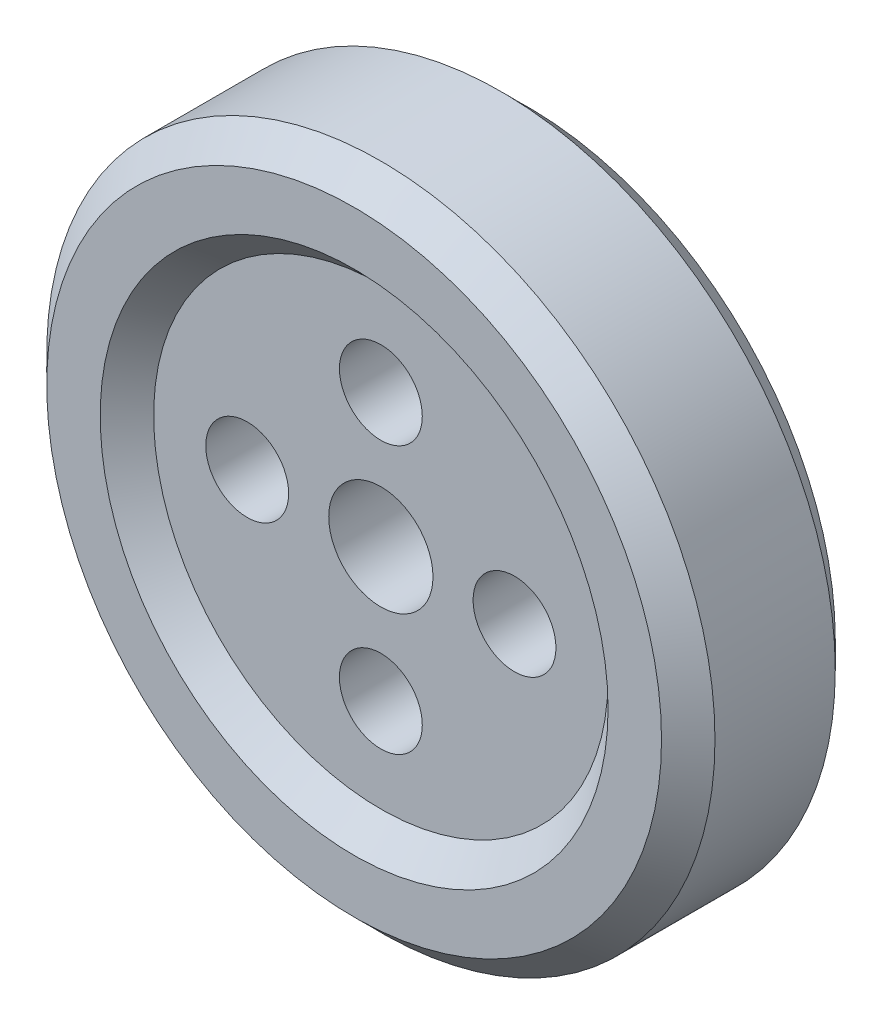
ISO-10303-21;
HEADER;
FILE_DESCRIPTION(('STEP AP214'),'2;1');
FILE_NAME('part.step','',(''),(''),'','','');
FILE_SCHEMA(('AUTOMOTIVE_DESIGN { 1 0 10303 214 1 1 1 1 }'));
ENDSEC;
DATA;
#1=APPLICATION_CONTEXT('core data for automotive mechanical design processes');
#2=APPLICATION_PROTOCOL_DEFINITION('international standard','automotive_design',2000,#1);
#3=PRODUCT_CONTEXT('',#1,'mechanical');
#4=PRODUCT('Part','Part','',(#3));
#5=PRODUCT_RELATED_PRODUCT_CATEGORY('part','',(#4));
#6=PRODUCT_DEFINITION_FORMATION('','',#4);
#7=PRODUCT_DEFINITION_CONTEXT('part definition',#1,'design');
#8=PRODUCT_DEFINITION('design','',#6,#7);
#9=PRODUCT_DEFINITION_SHAPE('','',#8);
#10=(LENGTH_UNIT() NAMED_UNIT(*) SI_UNIT(.MILLI.,.METRE.));
#11=(NAMED_UNIT(*) PLANE_ANGLE_UNIT() SI_UNIT($,.RADIAN.));
#12=(NAMED_UNIT(*) SI_UNIT($,.STERADIAN.) SOLID_ANGLE_UNIT());
#13=UNCERTAINTY_MEASURE_WITH_UNIT(LENGTH_MEASURE(1.E-05),#10,'distance_accuracy_value','');
#14=(GEOMETRIC_REPRESENTATION_CONTEXT(3) GLOBAL_UNCERTAINTY_ASSIGNED_CONTEXT((#13)) GLOBAL_UNIT_ASSIGNED_CONTEXT((#10,
#11,#12)) REPRESENTATION_CONTEXT('',''));
#15=CARTESIAN_POINT('',(0.,0.,0.));
#16=DIRECTION('',(0.,0.,1.));
#17=DIRECTION('',(1.,0.,0.));
#18=AXIS2_PLACEMENT_3D('',#15,#16,#17);
#19=CARTESIAN_POINT('',(0.,0.,65.));
#20=DIRECTION('',(0.,0.,-1.));
#21=DIRECTION('',(-1.,0.,0.));
#22=AXIS2_PLACEMENT_3D('',#19,#20,#21);
#23=CYLINDRICAL_SURFACE('',#22,250.);
#24=CARTESIAN_POINT('',(0.,0.,-45.));
#25=DIRECTION('',(0.,0.,1.));
#26=DIRECTION('',(1.,0.,0.));
#27=AXIS2_PLACEMENT_3D('',#24,#25,#26);
#28=CIRCLE('',#27,250.);
#29=CARTESIAN_POINT('',(250.,0.,-45.));
#30=VERTEX_POINT('',#29);
#31=EDGE_CURVE('E58',#30,#30,#28,.T.);
#32=ORIENTED_EDGE('',*,*,#31,.T.);
#33=EDGE_LOOP('',(#32));
#34=FACE_BOUND('',#33,.T.);
#35=CARTESIAN_POINT('',(0.,0.,44.9999999999999));
#36=DIRECTION('',(0.,0.,1.));
#37=DIRECTION('',(1.,0.,0.));
#38=AXIS2_PLACEMENT_3D('',#35,#36,#37);
#39=CIRCLE('',#38,250.);
#40=CARTESIAN_POINT('',(250.,0.,44.9999999999999));
#41=VERTEX_POINT('',#40);
#42=EDGE_CURVE('E64',#41,#41,#39,.F.);
#43=ORIENTED_EDGE('',*,*,#42,.T.);
#44=EDGE_LOOP('',(#43));
#45=FACE_BOUND('',#44,.T.);
#46=ADVANCED_FACE('F43',(#34,#45),#23,.T.);
#47=CARTESIAN_POINT('',(0.,0.,65.));
#48=DIRECTION('',(0.,0.,1.));
#49=DIRECTION('',(1.,0.,0.));
#50=AXIS2_PLACEMENT_3D('',#47,#48,#49);
#51=PLANE('',#50);
#52=CARTESIAN_POINT('',(0.,0.,65.));
#53=DIRECTION('',(0.,0.,1.));
#54=DIRECTION('',(1.,0.,0.));
#55=AXIS2_PLACEMENT_3D('',#52,#53,#54);
#56=CIRCLE('',#55,190.);
#57=CARTESIAN_POINT('',(190.,0.,65.));
#58=VERTEX_POINT('',#57);
#59=EDGE_CURVE('E72',#58,#58,#56,.T.);
#60=ORIENTED_EDGE('',*,*,#59,.F.);
#61=EDGE_LOOP('',(#60));
#62=FACE_BOUND('',#61,.T.);
#63=CARTESIAN_POINT('',(0.,0.,65.));
#64=DIRECTION('',(0.,0.,1.));
#65=DIRECTION('',(1.,0.,0.));
#66=AXIS2_PLACEMENT_3D('',#63,#64,#65);
#67=CIRCLE('',#66,230.);
#68=CARTESIAN_POINT('',(230.,0.,65.));
#69=VERTEX_POINT('',#68);
#70=EDGE_CURVE('E10',#69,#69,#67,.T.);
#71=ORIENTED_EDGE('',*,*,#70,.T.);
#72=EDGE_LOOP('',(#71));
#73=FACE_BOUND('',#72,.T.);
#74=ADVANCED_FACE('F148',(#62,#73),#51,.T.);
#75=CARTESIAN_POINT('',(0.,0.,-65.));
#76=DIRECTION('',(0.,0.,1.));
#77=DIRECTION('',(1.,0.,0.));
#78=AXIS2_PLACEMENT_3D('',#75,#76,#77);
#79=PLANE('',#78);
#80=CARTESIAN_POINT('',(0.,0.,-65.));
#81=DIRECTION('',(0.,0.,-1.));
#82=DIRECTION('',(-1.,0.,0.));
#83=AXIS2_PLACEMENT_3D('',#80,#81,#82);
#84=CIRCLE('',#83,190.);
#85=CARTESIAN_POINT('',(-190.,0.,-65.));
#86=VERTEX_POINT('',#85);
#87=EDGE_CURVE('E80',#86,#86,#84,.T.);
#88=ORIENTED_EDGE('',*,*,#87,.F.);
#89=EDGE_LOOP('',(#88));
#90=FACE_BOUND('',#89,.T.);
#91=CARTESIAN_POINT('',(0.,0.,-65.));
#92=DIRECTION('',(0.,0.,1.));
#93=DIRECTION('',(1.,0.,0.));
#94=AXIS2_PLACEMENT_3D('',#91,#92,#93);
#95=CIRCLE('',#94,230.);
#96=CARTESIAN_POINT('',(230.,0.,-65.));
#97=VERTEX_POINT('',#96);
#98=EDGE_CURVE('E53',#97,#97,#95,.F.);
#99=ORIENTED_EDGE('',*,*,#98,.T.);
#100=EDGE_LOOP('',(#99));
#101=FACE_BOUND('',#100,.T.);
#102=ADVANCED_FACE('F144',(#90,#101),#79,.F.);
#103=CARTESIAN_POINT('',(0.,0.,-45.));
#104=DIRECTION('',(0.,0.,1.));
#105=DIRECTION('',(1.,0.,0.));
#106=AXIS2_PLACEMENT_3D('',#103,#104,#105);
#107=CONICAL_SURFACE('',#106,250.,0.785398163397449);
#108=ORIENTED_EDGE('',*,*,#98,.F.);
#109=EDGE_LOOP('',(#108));
#110=FACE_BOUND('',#109,.T.);
#111=ORIENTED_EDGE('',*,*,#31,.F.);
#112=EDGE_LOOP('',(#111));
#113=FACE_BOUND('',#112,.T.);
#114=ADVANCED_FACE('F147',(#110,#113),#107,.T.);
#115=CARTESIAN_POINT('',(0.,0.,65.));
#116=DIRECTION('',(0.,0.,-1.));
#117=DIRECTION('',(-1.,0.,0.));
#118=AXIS2_PLACEMENT_3D('',#115,#116,#117);
#119=CONICAL_SURFACE('',#118,230.,0.785398163397444);
#120=ORIENTED_EDGE('',*,*,#42,.F.);
#121=EDGE_LOOP('',(#120));
#122=FACE_BOUND('',#121,.T.);
#123=ORIENTED_EDGE('',*,*,#70,.F.);
#124=EDGE_LOOP('',(#123));
#125=FACE_BOUND('',#124,.T.);
#126=ADVANCED_FACE('F46',(#122,#125),#119,.T.);
#127=CARTESIAN_POINT('',(0.,0.,65.));
#128=DIRECTION('',(0.,0.,1.));
#129=DIRECTION('',(1.,0.,0.));
#130=AXIS2_PLACEMENT_3D('',#127,#128,#129);
#131=CONICAL_SURFACE('',#130,190.,0.78539816339745);
#132=CARTESIAN_POINT('',(0.,0.,45.));
#133=DIRECTION('',(0.,0.,1.));
#134=DIRECTION('',(1.,0.,0.));
#135=AXIS2_PLACEMENT_3D('',#132,#133,#134);
#136=CIRCLE('',#135,170.);
#137=CARTESIAN_POINT('',(170.,0.,45.));
#138=VERTEX_POINT('',#137);
#139=EDGE_CURVE('E68',#138,#138,#136,.T.);
#140=ORIENTED_EDGE('',*,*,#139,.F.);
#141=EDGE_LOOP('',(#140));
#142=FACE_BOUND('',#141,.T.);
#143=ORIENTED_EDGE('',*,*,#59,.T.);
#144=EDGE_LOOP('',(#143));
#145=FACE_BOUND('',#144,.T.);
#146=ADVANCED_FACE('F163',(#142,#145),#131,.F.);
#147=CARTESIAN_POINT('',(0.,0.,45.));
#148=DIRECTION('',(0.,0.,1.));
#149=DIRECTION('',(1.,0.,0.));
#150=AXIS2_PLACEMENT_3D('',#147,#148,#149);
#151=PLANE('',#150);
#152=CARTESIAN_POINT('',(0.,100.,45.));
#153=DIRECTION('',(0.,0.,1.));
#154=DIRECTION('',(1.,0.,0.));
#155=AXIS2_PLACEMENT_3D('',#152,#153,#154);
#156=CIRCLE('',#155,31.);
#157=CARTESIAN_POINT('',(31.,100.,45.));
#158=VERTEX_POINT('',#157);
#159=EDGE_CURVE('E84',#158,#158,#156,.T.);
#160=ORIENTED_EDGE('',*,*,#159,.F.);
#161=EDGE_LOOP('',(#160));
#162=FACE_BOUND('',#161,.T.);
#163=CARTESIAN_POINT('',(0.,0.,45.));
#164=DIRECTION('',(0.,0.,1.));
#165=DIRECTION('',(1.,0.,0.));
#166=AXIS2_PLACEMENT_3D('',#163,#164,#165);
#167=CIRCLE('',#166,39.);
#168=CARTESIAN_POINT('',(39.,0.,45.));
#169=VERTEX_POINT('',#168);
#170=EDGE_CURVE('E48',#169,#169,#167,.T.);
#171=ORIENTED_EDGE('',*,*,#170,.F.);
#172=EDGE_LOOP('',(#171));
#173=FACE_BOUND('',#172,.T.);
#174=CARTESIAN_POINT('',(-100.,0.,45.));
#175=DIRECTION('',(0.,0.,1.));
#176=DIRECTION('',(1.,0.,0.));
#177=AXIS2_PLACEMENT_3D('',#174,#175,#176);
#178=CIRCLE('',#177,31.);
#179=CARTESIAN_POINT('',(-69.,0.,45.));
#180=VERTEX_POINT('',#179);
#181=EDGE_CURVE('E88',#180,#180,#178,.T.);
#182=ORIENTED_EDGE('',*,*,#181,.F.);
#183=EDGE_LOOP('',(#182));
#184=FACE_BOUND('',#183,.T.);
#185=CARTESIAN_POINT('',(0.,-100.,45.));
#186=DIRECTION('',(0.,0.,1.));
#187=DIRECTION('',(1.,0.,0.));
#188=AXIS2_PLACEMENT_3D('',#185,#186,#187);
#189=CIRCLE('',#188,31.);
#190=CARTESIAN_POINT('',(31.,-100.,45.));
#191=VERTEX_POINT('',#190);
#192=EDGE_CURVE('E92',#191,#191,#189,.T.);
#193=ORIENTED_EDGE('',*,*,#192,.F.);
#194=EDGE_LOOP('',(#193));
#195=FACE_BOUND('',#194,.T.);
#196=CARTESIAN_POINT('',(100.,0.,45.));
#197=DIRECTION('',(0.,0.,1.));
#198=DIRECTION('',(1.,0.,0.));
#199=AXIS2_PLACEMENT_3D('',#196,#197,#198);
#200=CIRCLE('',#199,31.);
#201=CARTESIAN_POINT('',(131.,0.,45.));
#202=VERTEX_POINT('',#201);
#203=EDGE_CURVE('E96',#202,#202,#200,.T.);
#204=ORIENTED_EDGE('',*,*,#203,.F.);
#205=EDGE_LOOP('',(#204));
#206=FACE_BOUND('',#205,.T.);
#207=ORIENTED_EDGE('',*,*,#139,.T.);
#208=EDGE_LOOP('',(#207));
#209=FACE_BOUND('',#208,.T.);
#210=ADVANCED_FACE('F140',(#162,#173,#184,#195,#206,#209),#151,.T.);
#211=CARTESIAN_POINT('',(0.,0.,-65.));
#212=DIRECTION('',(0.,0.,-1.));
#213=DIRECTION('',(-1.,0.,0.));
#214=AXIS2_PLACEMENT_3D('',#211,#212,#213);
#215=CONICAL_SURFACE('',#214,190.,0.78539816339745);
#216=CARTESIAN_POINT('',(0.,0.,-45.));
#217=DIRECTION('',(0.,0.,-1.));
#218=DIRECTION('',(-1.,0.,0.));
#219=AXIS2_PLACEMENT_3D('',#216,#217,#218);
#220=CIRCLE('',#219,170.);
#221=CARTESIAN_POINT('',(-170.,0.,-45.));
#222=VERTEX_POINT('',#221);
#223=EDGE_CURVE('E76',#222,#222,#220,.T.);
#224=ORIENTED_EDGE('',*,*,#223,.F.);
#225=EDGE_LOOP('',(#224));
#226=FACE_BOUND('',#225,.T.);
#227=ORIENTED_EDGE('',*,*,#87,.T.);
#228=EDGE_LOOP('',(#227));
#229=FACE_BOUND('',#228,.T.);
#230=ADVANCED_FACE('F127',(#226,#229),#215,.F.);
#231=CARTESIAN_POINT('',(0.,0.,-45.));
#232=DIRECTION('',(0.,0.,-1.));
#233=DIRECTION('',(-1.,0.,0.));
#234=AXIS2_PLACEMENT_3D('',#231,#232,#233);
#235=PLANE('',#234);
#236=CARTESIAN_POINT('',(0.,0.,-45.));
#237=DIRECTION('',(0.,0.,-1.));
#238=DIRECTION('',(-1.,0.,0.));
#239=AXIS2_PLACEMENT_3D('',#236,#237,#238);
#240=CIRCLE('',#239,39.);
#241=CARTESIAN_POINT('',(-39.,0.,-45.));
#242=VERTEX_POINT('',#241);
#243=EDGE_CURVE('E110',#242,#242,#240,.T.);
#244=ORIENTED_EDGE('',*,*,#243,.F.);
#245=EDGE_LOOP('',(#244));
#246=FACE_BOUND('',#245,.T.);
#247=CARTESIAN_POINT('',(0.,100.,-45.));
#248=DIRECTION('',(0.,0.,-1.));
#249=DIRECTION('',(-1.,0.,0.));
#250=AXIS2_PLACEMENT_3D('',#247,#248,#249);
#251=CIRCLE('',#250,31.);
#252=CARTESIAN_POINT('',(-31.,100.,-45.));
#253=VERTEX_POINT('',#252);
#254=EDGE_CURVE('E100',#253,#253,#251,.T.);
#255=ORIENTED_EDGE('',*,*,#254,.F.);
#256=EDGE_LOOP('',(#255));
#257=FACE_BOUND('',#256,.T.);
#258=CARTESIAN_POINT('',(-100.,0.,-45.));
#259=DIRECTION('',(0.,0.,-1.));
#260=DIRECTION('',(-1.,0.,0.));
#261=AXIS2_PLACEMENT_3D('',#258,#259,#260);
#262=CIRCLE('',#261,31.);
#263=CARTESIAN_POINT('',(-131.,0.,-45.));
#264=VERTEX_POINT('',#263);
#265=EDGE_CURVE('E106',#264,#264,#262,.T.);
#266=ORIENTED_EDGE('',*,*,#265,.F.);
#267=EDGE_LOOP('',(#266));
#268=FACE_BOUND('',#267,.T.);
#269=CARTESIAN_POINT('',(0.,-100.,-45.));
#270=DIRECTION('',(0.,0.,-1.));
#271=DIRECTION('',(-1.,0.,0.));
#272=AXIS2_PLACEMENT_3D('',#269,#270,#271);
#273=CIRCLE('',#272,31.);
#274=CARTESIAN_POINT('',(-31.,-100.,-45.));
#275=VERTEX_POINT('',#274);
#276=EDGE_CURVE('E101',#275,#275,#273,.T.);
#277=ORIENTED_EDGE('',*,*,#276,.F.);
#278=EDGE_LOOP('',(#277));
#279=FACE_BOUND('',#278,.T.);
#280=CARTESIAN_POINT('',(100.,0.,-45.));
#281=DIRECTION('',(0.,0.,-1.));
#282=DIRECTION('',(-1.,0.,0.));
#283=AXIS2_PLACEMENT_3D('',#280,#281,#282);
#284=CIRCLE('',#283,31.);
#285=CARTESIAN_POINT('',(69.,0.,-45.));
#286=VERTEX_POINT('',#285);
#287=EDGE_CURVE('E105',#286,#286,#284,.T.);
#288=ORIENTED_EDGE('',*,*,#287,.F.);
#289=EDGE_LOOP('',(#288));
#290=FACE_BOUND('',#289,.T.);
#291=ORIENTED_EDGE('',*,*,#223,.T.);
#292=EDGE_LOOP('',(#291));
#293=FACE_BOUND('',#292,.T.);
#294=ADVANCED_FACE('F123',(#246,#257,#268,#279,#290,#293),#235,.T.);
#295=CARTESIAN_POINT('',(100.,0.,65.));
#296=DIRECTION('',(0.,0.,-1.));
#297=DIRECTION('',(-1.,0.,0.));
#298=AXIS2_PLACEMENT_3D('',#295,#296,#297);
#299=CYLINDRICAL_SURFACE('',#298,31.);
#300=ORIENTED_EDGE('',*,*,#203,.T.);
#301=EDGE_LOOP('',(#300));
#302=FACE_BOUND('',#301,.T.);
#303=ORIENTED_EDGE('',*,*,#287,.T.);
#304=EDGE_LOOP('',(#303));
#305=FACE_BOUND('',#304,.T.);
#306=ADVANCED_FACE('F126',(#302,#305),#299,.F.);
#307=CARTESIAN_POINT('',(0.,-100.,65.));
#308=DIRECTION('',(0.,0.,-1.));
#309=DIRECTION('',(-1.,0.,0.));
#310=AXIS2_PLACEMENT_3D('',#307,#308,#309);
#311=CYLINDRICAL_SURFACE('',#310,31.);
#312=ORIENTED_EDGE('',*,*,#192,.T.);
#313=EDGE_LOOP('',(#312));
#314=FACE_BOUND('',#313,.T.);
#315=ORIENTED_EDGE('',*,*,#276,.T.);
#316=EDGE_LOOP('',(#315));
#317=FACE_BOUND('',#316,.T.);
#318=ADVANCED_FACE('F244',(#314,#317),#311,.F.);
#319=CARTESIAN_POINT('',(-100.,0.,65.));
#320=DIRECTION('',(0.,0.,-1.));
#321=DIRECTION('',(-1.,0.,0.));
#322=AXIS2_PLACEMENT_3D('',#319,#320,#321);
#323=CYLINDRICAL_SURFACE('',#322,31.);
#324=ORIENTED_EDGE('',*,*,#181,.T.);
#325=EDGE_LOOP('',(#324));
#326=FACE_BOUND('',#325,.T.);
#327=ORIENTED_EDGE('',*,*,#265,.T.);
#328=EDGE_LOOP('',(#327));
#329=FACE_BOUND('',#328,.T.);
#330=ADVANCED_FACE('F255',(#326,#329),#323,.F.);
#331=CARTESIAN_POINT('',(0.,100.,65.));
#332=DIRECTION('',(0.,0.,-1.));
#333=DIRECTION('',(-1.,0.,0.));
#334=AXIS2_PLACEMENT_3D('',#331,#332,#333);
#335=CYLINDRICAL_SURFACE('',#334,31.);
#336=ORIENTED_EDGE('',*,*,#159,.T.);
#337=EDGE_LOOP('',(#336));
#338=FACE_BOUND('',#337,.T.);
#339=ORIENTED_EDGE('',*,*,#254,.T.);
#340=EDGE_LOOP('',(#339));
#341=FACE_BOUND('',#340,.T.);
#342=ADVANCED_FACE('F121',(#338,#341),#335,.F.);
#343=CARTESIAN_POINT('',(0.,0.,65.));
#344=DIRECTION('',(0.,0.,-1.));
#345=DIRECTION('',(-1.,0.,0.));
#346=AXIS2_PLACEMENT_3D('',#343,#344,#345);
#347=CYLINDRICAL_SURFACE('',#346,39.);
#348=ORIENTED_EDGE('',*,*,#170,.T.);
#349=EDGE_LOOP('',(#348));
#350=FACE_BOUND('',#349,.T.);
#351=ORIENTED_EDGE('',*,*,#243,.T.);
#352=EDGE_LOOP('',(#351));
#353=FACE_BOUND('',#352,.T.);
#354=ADVANCED_FACE('F276',(#350,#353),#347,.F.);
#355=CLOSED_SHELL('',(#46,#74,#102,#114,#126,#146,#210,#230,#294,#306,#318,#330,#342,#354));
#356=MANIFOLD_SOLID_BREP('B2',#355);
#357=ADVANCED_BREP_SHAPE_REPRESENTATION('',(#18,#356),#14);
#358=SHAPE_DEFINITION_REPRESENTATION(#9,#357);
ENDSEC;
END-ISO-10303-21;
